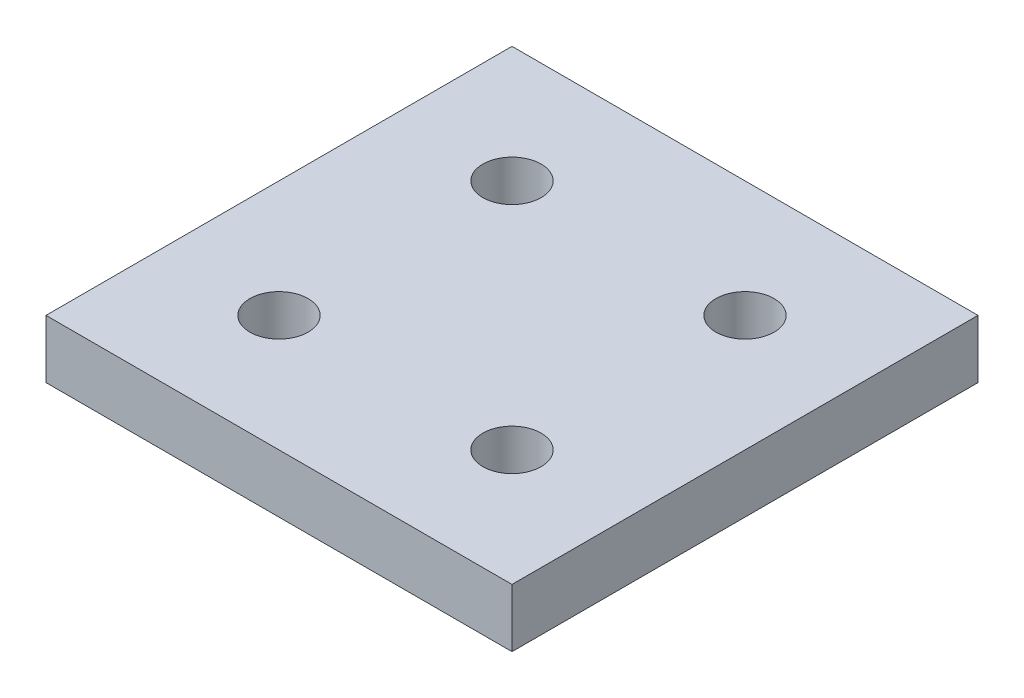
ISO-10303-21;
HEADER;
FILE_DESCRIPTION(('STEP AP214'),'2;1');
FILE_NAME('part.step','',(''),(''),'','','');
FILE_SCHEMA(('AUTOMOTIVE_DESIGN { 1 0 10303 214 1 1 1 1 }'));
ENDSEC;
DATA;
#1=APPLICATION_CONTEXT('core data for automotive mechanical design processes');
#2=APPLICATION_PROTOCOL_DEFINITION('international standard','automotive_design',2000,#1);
#3=PRODUCT_CONTEXT('',#1,'mechanical');
#4=PRODUCT('Part','Part','',(#3));
#5=PRODUCT_RELATED_PRODUCT_CATEGORY('part','',(#4));
#6=PRODUCT_DEFINITION_FORMATION('','',#4);
#7=PRODUCT_DEFINITION_CONTEXT('part definition',#1,'design');
#8=PRODUCT_DEFINITION('design','',#6,#7);
#9=PRODUCT_DEFINITION_SHAPE('','',#8);
#10=(LENGTH_UNIT() NAMED_UNIT(*) SI_UNIT(.MILLI.,.METRE.));
#11=(NAMED_UNIT(*) PLANE_ANGLE_UNIT() SI_UNIT($,.RADIAN.));
#12=(NAMED_UNIT(*) SI_UNIT($,.STERADIAN.) SOLID_ANGLE_UNIT());
#13=UNCERTAINTY_MEASURE_WITH_UNIT(LENGTH_MEASURE(1.E-05),#10,'distance_accuracy_value','');
#14=(GEOMETRIC_REPRESENTATION_CONTEXT(3) GLOBAL_UNCERTAINTY_ASSIGNED_CONTEXT((#13)) GLOBAL_UNIT_ASSIGNED_CONTEXT((#10,
#11,#12)) REPRESENTATION_CONTEXT('',''));
#15=CARTESIAN_POINT('',(0.,0.,0.));
#16=DIRECTION('',(0.,0.,1.));
#17=DIRECTION('',(1.,0.,0.));
#18=AXIS2_PLACEMENT_3D('',#15,#16,#17);
#19=CARTESIAN_POINT('',(0.,5.,0.));
#20=DIRECTION('',(0.,1.,0.));
#21=DIRECTION('',(0.,0.,1.));
#22=AXIS2_PLACEMENT_3D('',#19,#20,#21);
#23=PLANE('',#22);
#24=CARTESIAN_POINT('',(10.,5.,30.));
#25=DIRECTION('',(0.,1.,0.));
#26=DIRECTION('',(0.,0.,-1.));
#27=AXIS2_PLACEMENT_3D('',#24,#25,#26);
#28=CIRCLE('',#27,2.5);
#29=CARTESIAN_POINT('',(10.,5.,27.5));
#30=VERTEX_POINT('',#29);
#31=EDGE_CURVE('E129',#30,#30,#28,.T.);
#32=ORIENTED_EDGE('',*,*,#31,.F.);
#33=EDGE_LOOP('',(#32));
#34=FACE_BOUND('',#33,.T.);
#35=CARTESIAN_POINT('',(10.,5.,10.));
#36=DIRECTION('',(0.,1.,0.));
#37=DIRECTION('',(0.,0.,1.));
#38=AXIS2_PLACEMENT_3D('',#35,#36,#37);
#39=CIRCLE('',#38,2.5);
#40=CARTESIAN_POINT('',(10.,5.,12.5));
#41=VERTEX_POINT('',#40);
#42=EDGE_CURVE('E108',#41,#41,#39,.T.);
#43=ORIENTED_EDGE('',*,*,#42,.F.);
#44=EDGE_LOOP('',(#43));
#45=FACE_BOUND('',#44,.T.);
#46=DIRECTION('',(0.,0.,1.));
#47=VECTOR('',#46,1.);
#48=CARTESIAN_POINT('',(0.,5.,0.));
#49=LINE('',#48,#47);
#50=CARTESIAN_POINT('',(0.,5.,0.));
#51=VERTEX_POINT('',#50);
#52=CARTESIAN_POINT('',(0.,5.,40.));
#53=VERTEX_POINT('',#52);
#54=EDGE_CURVE('E93',#51,#53,#49,.T.);
#55=ORIENTED_EDGE('',*,*,#54,.T.);
#56=DIRECTION('',(1.,0.,0.));
#57=VECTOR('',#56,1.);
#58=CARTESIAN_POINT('',(0.,5.,40.));
#59=LINE('',#58,#57);
#60=CARTESIAN_POINT('',(40.,5.,40.));
#61=VERTEX_POINT('',#60);
#62=EDGE_CURVE('E88',#53,#61,#59,.T.);
#63=ORIENTED_EDGE('',*,*,#62,.T.);
#64=DIRECTION('',(0.,0.,-1.));
#65=VECTOR('',#64,1.);
#66=CARTESIAN_POINT('',(40.,5.,0.));
#67=LINE('',#66,#65);
#68=CARTESIAN_POINT('',(40.,5.,0.));
#69=VERTEX_POINT('',#68);
#70=EDGE_CURVE('E91',#61,#69,#67,.T.);
#71=ORIENTED_EDGE('',*,*,#70,.T.);
#72=DIRECTION('',(-1.,0.,0.));
#73=VECTOR('',#72,1.);
#74=CARTESIAN_POINT('',(0.,5.,0.));
#75=LINE('',#74,#73);
#76=EDGE_CURVE('E58',#69,#51,#75,.T.);
#77=ORIENTED_EDGE('',*,*,#76,.T.);
#78=EDGE_LOOP('',(#55,#63,#71,#77));
#79=FACE_BOUND('',#78,.T.);
#80=CARTESIAN_POINT('',(30.,5.,30.));
#81=DIRECTION('',(0.,1.,0.));
#82=DIRECTION('',(0.,0.,-1.));
#83=AXIS2_PLACEMENT_3D('',#80,#81,#82);
#84=CIRCLE('',#83,2.49999999999999);
#85=CARTESIAN_POINT('',(30.,5.,27.5));
#86=VERTEX_POINT('',#85);
#87=EDGE_CURVE('E123',#86,#86,#84,.T.);
#88=ORIENTED_EDGE('',*,*,#87,.F.);
#89=EDGE_LOOP('',(#88));
#90=FACE_BOUND('',#89,.T.);
#91=CARTESIAN_POINT('',(30.,5.,10.));
#92=DIRECTION('',(0.,1.,0.));
#93=DIRECTION('',(0.,0.,1.));
#94=AXIS2_PLACEMENT_3D('',#91,#92,#93);
#95=CIRCLE('',#94,2.49999999999999);
#96=CARTESIAN_POINT('',(30.,5.,12.5));
#97=VERTEX_POINT('',#96);
#98=EDGE_CURVE('E135',#97,#97,#95,.T.);
#99=ORIENTED_EDGE('',*,*,#98,.F.);
#100=EDGE_LOOP('',(#99));
#101=FACE_BOUND('',#100,.T.);
#102=ADVANCED_FACE('F41',(#34,#45,#79,#90,#101),#23,.T.);
#103=CARTESIAN_POINT('',(0.,0.,0.));
#104=DIRECTION('',(0.,1.,0.));
#105=DIRECTION('',(0.,0.,1.));
#106=AXIS2_PLACEMENT_3D('',#103,#104,#105);
#107=PLANE('',#106);
#108=DIRECTION('',(0.,0.,1.));
#109=VECTOR('',#108,1.);
#110=CARTESIAN_POINT('',(0.,0.,0.));
#111=LINE('',#110,#109);
#112=CARTESIAN_POINT('',(0.,0.,0.));
#113=VERTEX_POINT('',#112);
#114=CARTESIAN_POINT('',(0.,0.,40.));
#115=VERTEX_POINT('',#114);
#116=EDGE_CURVE('E105',#113,#115,#111,.T.);
#117=ORIENTED_EDGE('',*,*,#116,.F.);
#118=DIRECTION('',(-1.,0.,0.));
#119=VECTOR('',#118,1.);
#120=CARTESIAN_POINT('',(0.,0.,0.));
#121=LINE('',#120,#119);
#122=CARTESIAN_POINT('',(40.,0.,0.));
#123=VERTEX_POINT('',#122);
#124=EDGE_CURVE('E81',#123,#113,#121,.T.);
#125=ORIENTED_EDGE('',*,*,#124,.F.);
#126=DIRECTION('',(0.,0.,-1.));
#127=VECTOR('',#126,1.);
#128=CARTESIAN_POINT('',(40.,0.,0.));
#129=LINE('',#128,#127);
#130=CARTESIAN_POINT('',(40.,0.,40.));
#131=VERTEX_POINT('',#130);
#132=EDGE_CURVE('E75',#131,#123,#129,.T.);
#133=ORIENTED_EDGE('',*,*,#132,.F.);
#134=DIRECTION('',(1.,0.,0.));
#135=VECTOR('',#134,1.);
#136=CARTESIAN_POINT('',(0.,0.,40.));
#137=LINE('',#136,#135);
#138=EDGE_CURVE('E97',#115,#131,#137,.T.);
#139=ORIENTED_EDGE('',*,*,#138,.F.);
#140=EDGE_LOOP('',(#117,#125,#133,#139));
#141=FACE_BOUND('',#140,.T.);
#142=CARTESIAN_POINT('',(10.,0.,10.));
#143=DIRECTION('',(0.,1.,0.));
#144=DIRECTION('',(0.,0.,1.));
#145=AXIS2_PLACEMENT_3D('',#142,#143,#144);
#146=CIRCLE('',#145,2.5);
#147=CARTESIAN_POINT('',(10.,0.,12.5));
#148=VERTEX_POINT('',#147);
#149=EDGE_CURVE('E120',#148,#148,#146,.T.);
#150=ORIENTED_EDGE('',*,*,#149,.T.);
#151=EDGE_LOOP('',(#150));
#152=FACE_BOUND('',#151,.T.);
#153=CARTESIAN_POINT('',(30.,0.,30.));
#154=DIRECTION('',(0.,1.,0.));
#155=DIRECTION('',(0.,0.,-1.));
#156=AXIS2_PLACEMENT_3D('',#153,#154,#155);
#157=CIRCLE('',#156,2.49999999999999);
#158=CARTESIAN_POINT('',(30.,0.,27.5));
#159=VERTEX_POINT('',#158);
#160=EDGE_CURVE('E126',#159,#159,#157,.T.);
#161=ORIENTED_EDGE('',*,*,#160,.T.);
#162=EDGE_LOOP('',(#161));
#163=FACE_BOUND('',#162,.T.);
#164=CARTESIAN_POINT('',(10.,0.,30.));
#165=DIRECTION('',(0.,1.,0.));
#166=DIRECTION('',(0.,0.,-1.));
#167=AXIS2_PLACEMENT_3D('',#164,#165,#166);
#168=CIRCLE('',#167,2.5);
#169=CARTESIAN_POINT('',(10.,0.,27.5));
#170=VERTEX_POINT('',#169);
#171=EDGE_CURVE('E132',#170,#170,#168,.T.);
#172=ORIENTED_EDGE('',*,*,#171,.T.);
#173=EDGE_LOOP('',(#172));
#174=FACE_BOUND('',#173,.T.);
#175=CARTESIAN_POINT('',(30.,0.,10.));
#176=DIRECTION('',(0.,1.,0.));
#177=DIRECTION('',(0.,0.,1.));
#178=AXIS2_PLACEMENT_3D('',#175,#176,#177);
#179=CIRCLE('',#178,2.49999999999999);
#180=CARTESIAN_POINT('',(30.,0.,12.5));
#181=VERTEX_POINT('',#180);
#182=EDGE_CURVE('E138',#181,#181,#179,.T.);
#183=ORIENTED_EDGE('',*,*,#182,.T.);
#184=EDGE_LOOP('',(#183));
#185=FACE_BOUND('',#184,.T.);
#186=ADVANCED_FACE('F116',(#141,#152,#163,#174,#185),#107,.F.);
#187=CARTESIAN_POINT('',(0.,5.,0.));
#188=DIRECTION('',(1.,0.,0.));
#189=DIRECTION('',(0.,0.,-1.));
#190=AXIS2_PLACEMENT_3D('',#187,#188,#189);
#191=PLANE('',#190);
#192=ORIENTED_EDGE('',*,*,#116,.T.);
#193=DIRECTION('',(0.,-1.,0.));
#194=VECTOR('',#193,1.);
#195=CARTESIAN_POINT('',(0.,5.,40.));
#196=LINE('',#195,#194);
#197=EDGE_CURVE('E11',#53,#115,#196,.T.);
#198=ORIENTED_EDGE('',*,*,#197,.F.);
#199=ORIENTED_EDGE('',*,*,#54,.F.);
#200=DIRECTION('',(0.,-1.,0.));
#201=VECTOR('',#200,1.);
#202=CARTESIAN_POINT('',(0.,5.,0.));
#203=LINE('',#202,#201);
#204=EDGE_CURVE('E101',#51,#113,#203,.T.);
#205=ORIENTED_EDGE('',*,*,#204,.T.);
#206=EDGE_LOOP('',(#192,#198,#199,#205));
#207=FACE_BOUND('',#206,.T.);
#208=ADVANCED_FACE('F43',(#207),#191,.F.);
#209=CARTESIAN_POINT('',(0.,5.,40.));
#210=DIRECTION('',(0.,0.,-1.));
#211=DIRECTION('',(-1.,0.,0.));
#212=AXIS2_PLACEMENT_3D('',#209,#210,#211);
#213=PLANE('',#212);
#214=ORIENTED_EDGE('',*,*,#138,.T.);
#215=DIRECTION('',(0.,-1.,0.));
#216=VECTOR('',#215,1.);
#217=CARTESIAN_POINT('',(40.,5.,40.));
#218=LINE('',#217,#216);
#219=EDGE_CURVE('E50',#61,#131,#218,.T.);
#220=ORIENTED_EDGE('',*,*,#219,.F.);
#221=ORIENTED_EDGE('',*,*,#62,.F.);
#222=ORIENTED_EDGE('',*,*,#197,.T.);
#223=EDGE_LOOP('',(#214,#220,#221,#222));
#224=FACE_BOUND('',#223,.T.);
#225=ADVANCED_FACE('F96',(#224),#213,.F.);
#226=CARTESIAN_POINT('',(40.,5.,0.));
#227=DIRECTION('',(-1.,0.,0.));
#228=DIRECTION('',(0.,0.,1.));
#229=AXIS2_PLACEMENT_3D('',#226,#227,#228);
#230=PLANE('',#229);
#231=ORIENTED_EDGE('',*,*,#132,.T.);
#232=DIRECTION('',(0.,-1.,0.));
#233=VECTOR('',#232,1.);
#234=CARTESIAN_POINT('',(40.,5.,0.));
#235=LINE('',#234,#233);
#236=EDGE_CURVE('E98',#69,#123,#235,.T.);
#237=ORIENTED_EDGE('',*,*,#236,.F.);
#238=ORIENTED_EDGE('',*,*,#70,.F.);
#239=ORIENTED_EDGE('',*,*,#219,.T.);
#240=EDGE_LOOP('',(#231,#237,#238,#239));
#241=FACE_BOUND('',#240,.T.);
#242=ADVANCED_FACE('F99',(#241),#230,.F.);
#243=CARTESIAN_POINT('',(0.,5.,0.));
#244=DIRECTION('',(0.,0.,1.));
#245=DIRECTION('',(1.,0.,0.));
#246=AXIS2_PLACEMENT_3D('',#243,#244,#245);
#247=PLANE('',#246);
#248=ORIENTED_EDGE('',*,*,#124,.T.);
#249=ORIENTED_EDGE('',*,*,#204,.F.);
#250=ORIENTED_EDGE('',*,*,#76,.F.);
#251=ORIENTED_EDGE('',*,*,#236,.T.);
#252=EDGE_LOOP('',(#248,#249,#250,#251));
#253=FACE_BOUND('',#252,.T.);
#254=ADVANCED_FACE('F113',(#253),#247,.F.);
#255=CARTESIAN_POINT('',(10.,5.,10.));
#256=DIRECTION('',(0.,-1.,0.));
#257=DIRECTION('',(0.,0.,-1.));
#258=AXIS2_PLACEMENT_3D('',#255,#256,#257);
#259=CYLINDRICAL_SURFACE('',#258,2.5);
#260=ORIENTED_EDGE('',*,*,#42,.T.);
#261=EDGE_LOOP('',(#260));
#262=FACE_BOUND('',#261,.T.);
#263=ORIENTED_EDGE('',*,*,#149,.F.);
#264=EDGE_LOOP('',(#263));
#265=FACE_BOUND('',#264,.T.);
#266=ADVANCED_FACE('F157',(#262,#265),#259,.F.);
#267=CARTESIAN_POINT('',(30.,5.,30.));
#268=DIRECTION('',(0.,-1.,0.));
#269=DIRECTION('',(0.,0.,-1.));
#270=AXIS2_PLACEMENT_3D('',#267,#268,#269);
#271=CYLINDRICAL_SURFACE('',#270,2.49999999999999);
#272=ORIENTED_EDGE('',*,*,#87,.T.);
#273=EDGE_LOOP('',(#272));
#274=FACE_BOUND('',#273,.T.);
#275=ORIENTED_EDGE('',*,*,#160,.F.);
#276=EDGE_LOOP('',(#275));
#277=FACE_BOUND('',#276,.T.);
#278=ADVANCED_FACE('F202',(#274,#277),#271,.F.);
#279=CARTESIAN_POINT('',(10.,5.,30.));
#280=DIRECTION('',(0.,-1.,0.));
#281=DIRECTION('',(0.,0.,-1.));
#282=AXIS2_PLACEMENT_3D('',#279,#280,#281);
#283=CYLINDRICAL_SURFACE('',#282,2.5);
#284=ORIENTED_EDGE('',*,*,#31,.T.);
#285=EDGE_LOOP('',(#284));
#286=FACE_BOUND('',#285,.T.);
#287=ORIENTED_EDGE('',*,*,#171,.F.);
#288=EDGE_LOOP('',(#287));
#289=FACE_BOUND('',#288,.T.);
#290=ADVANCED_FACE('F210',(#286,#289),#283,.F.);
#291=CARTESIAN_POINT('',(30.,5.,10.));
#292=DIRECTION('',(0.,-1.,0.));
#293=DIRECTION('',(0.,0.,-1.));
#294=AXIS2_PLACEMENT_3D('',#291,#292,#293);
#295=CYLINDRICAL_SURFACE('',#294,2.49999999999999);
#296=ORIENTED_EDGE('',*,*,#98,.T.);
#297=EDGE_LOOP('',(#296));
#298=FACE_BOUND('',#297,.T.);
#299=ORIENTED_EDGE('',*,*,#182,.F.);
#300=EDGE_LOOP('',(#299));
#301=FACE_BOUND('',#300,.T.);
#302=ADVANCED_FACE('F144',(#298,#301),#295,.F.);
#303=CLOSED_SHELL('',(#102,#186,#208,#225,#242,#254,#266,#278,#290,#302));
#304=MANIFOLD_SOLID_BREP('B2',#303);
#305=ADVANCED_BREP_SHAPE_REPRESENTATION('',(#18,#304),#14);
#306=SHAPE_DEFINITION_REPRESENTATION(#9,#305);
ENDSEC;
END-ISO-10303-21;
